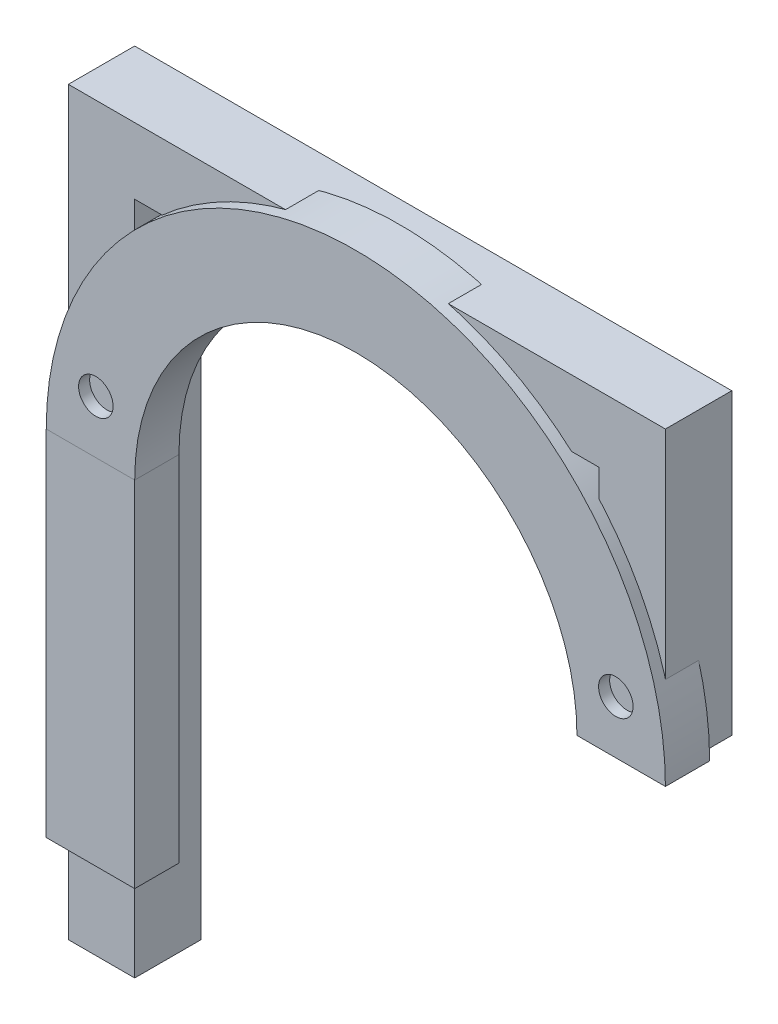
ISO-10303-21;
HEADER;
FILE_DESCRIPTION(('STEP AP214'),'2;1');
FILE_NAME('part.step','',(''),(''),'','','');
FILE_SCHEMA(('AUTOMOTIVE_DESIGN { 1 0 10303 214 1 1 1 1 }'));
ENDSEC;
DATA;
#1=APPLICATION_CONTEXT('core data for automotive mechanical design processes');
#2=APPLICATION_PROTOCOL_DEFINITION('international standard','automotive_design',2000,#1);
#3=PRODUCT_CONTEXT('',#1,'mechanical');
#4=PRODUCT('Part','Part','',(#3));
#5=PRODUCT_RELATED_PRODUCT_CATEGORY('part','',(#4));
#6=PRODUCT_DEFINITION_FORMATION('','',#4);
#7=PRODUCT_DEFINITION_CONTEXT('part definition',#1,'design');
#8=PRODUCT_DEFINITION('design','',#6,#7);
#9=PRODUCT_DEFINITION_SHAPE('','',#8);
#10=(LENGTH_UNIT() NAMED_UNIT(*) SI_UNIT(.MILLI.,.METRE.));
#11=(NAMED_UNIT(*) PLANE_ANGLE_UNIT() SI_UNIT($,.RADIAN.));
#12=(NAMED_UNIT(*) SI_UNIT($,.STERADIAN.) SOLID_ANGLE_UNIT());
#13=UNCERTAINTY_MEASURE_WITH_UNIT(LENGTH_MEASURE(1.E-05),#10,'distance_accuracy_value','');
#14=(GEOMETRIC_REPRESENTATION_CONTEXT(3) GLOBAL_UNCERTAINTY_ASSIGNED_CONTEXT((#13)) GLOBAL_UNIT_ASSIGNED_CONTEXT((#10,
#11,#12)) REPRESENTATION_CONTEXT('',''));
#15=CARTESIAN_POINT('',(0.,0.,0.));
#16=DIRECTION('',(0.,0.,1.));
#17=DIRECTION('',(1.,0.,0.));
#18=AXIS2_PLACEMENT_3D('',#15,#16,#17);
#19=CARTESIAN_POINT('',(-6.35,0.,0.));
#20=DIRECTION('',(-1.,0.,0.));
#21=DIRECTION('',(0.,0.,1.));
#22=AXIS2_PLACEMENT_3D('',#19,#20,#21);
#23=PLANE('',#22);
#24=DIRECTION('',(0.,1.,0.));
#25=VECTOR('',#24,1.);
#26=CARTESIAN_POINT('',(-6.35,0.,0.));
#27=LINE('',#26,#25);
#28=CARTESIAN_POINT('',(-6.35,12.7,0.));
#29=VERTEX_POINT('',#28);
#30=CARTESIAN_POINT('',(-6.35,63.5,0.));
#31=VERTEX_POINT('',#30);
#32=EDGE_CURVE('E163',#29,#31,#27,.T.);
#33=ORIENTED_EDGE('',*,*,#32,.F.);
#34=DIRECTION('',(0.,0.,-1.));
#35=VECTOR('',#34,1.);
#36=CARTESIAN_POINT('',(-6.35,12.7,6.35));
#37=LINE('',#36,#35);
#38=CARTESIAN_POINT('',(-6.35,12.7,6.35));
#39=VERTEX_POINT('',#38);
#40=EDGE_CURVE('E145',#39,#29,#37,.T.);
#41=ORIENTED_EDGE('',*,*,#40,.F.);
#42=DIRECTION('',(0.,1.,0.));
#43=VECTOR('',#42,1.);
#44=CARTESIAN_POINT('',(-6.35,0.,6.35));
#45=LINE('',#44,#43);
#46=CARTESIAN_POINT('',(-6.35,63.5,6.35));
#47=VERTEX_POINT('',#46);
#48=EDGE_CURVE('E175',#39,#47,#45,.T.);
#49=ORIENTED_EDGE('',*,*,#48,.T.);
#50=DIRECTION('',(0.,0.,1.));
#51=VECTOR('',#50,1.);
#52=CARTESIAN_POINT('',(-6.35,63.5,0.));
#53=LINE('',#52,#51);
#54=EDGE_CURVE('E172',#31,#47,#53,.T.);
#55=ORIENTED_EDGE('',*,*,#54,.F.);
#56=EDGE_LOOP('',(#33,#41,#49,#55));
#57=FACE_BOUND('',#56,.T.);
#58=ADVANCED_FACE('F45',(#57),#23,.T.);
#59=CARTESIAN_POINT('',(-6.35,0.,6.35));
#60=DIRECTION('',(0.,0.,1.));
#61=DIRECTION('',(1.,0.,0.));
#62=AXIS2_PLACEMENT_3D('',#59,#60,#61);
#63=PLANE('',#62);
#64=ORIENTED_EDGE('',*,*,#48,.F.);
#65=DIRECTION('',(-1.,0.,0.));
#66=VECTOR('',#65,1.);
#67=CARTESIAN_POINT('',(-6.35,12.7,6.35));
#68=LINE('',#67,#66);
#69=CARTESIAN_POINT('',(6.35,12.7,6.35));
#70=VERTEX_POINT('',#69);
#71=EDGE_CURVE('E157',#70,#39,#68,.T.);
#72=ORIENTED_EDGE('',*,*,#71,.F.);
#73=DIRECTION('',(0.,1.,0.));
#74=VECTOR('',#73,1.);
#75=CARTESIAN_POINT('',(6.35,0.,6.35));
#76=LINE('',#75,#74);
#77=CARTESIAN_POINT('',(6.35,63.5,6.35));
#78=VERTEX_POINT('',#77);
#79=EDGE_CURVE('E191',#70,#78,#76,.T.);
#80=ORIENTED_EDGE('',*,*,#79,.T.);
#81=DIRECTION('',(1.,0.,0.));
#82=VECTOR('',#81,1.);
#83=CARTESIAN_POINT('',(-6.35,63.5,6.35));
#84=LINE('',#83,#82);
#85=EDGE_CURVE('E177',#47,#78,#84,.T.);
#86=ORIENTED_EDGE('',*,*,#85,.F.);
#87=EDGE_LOOP('',(#64,#72,#80,#86));
#88=FACE_BOUND('',#87,.T.);
#89=ADVANCED_FACE('F262',(#88),#63,.T.);
#90=CARTESIAN_POINT('',(6.35,0.,0.));
#91=DIRECTION('',(1.,0.,0.));
#92=DIRECTION('',(0.,0.,-1.));
#93=AXIS2_PLACEMENT_3D('',#90,#91,#92);
#94=PLANE('',#93);
#95=ORIENTED_EDGE('',*,*,#79,.F.);
#96=DIRECTION('',(0.,0.,1.));
#97=VECTOR('',#96,1.);
#98=CARTESIAN_POINT('',(6.35,12.7,6.35));
#99=LINE('',#98,#97);
#100=CARTESIAN_POINT('',(6.35,12.7,0.));
#101=VERTEX_POINT('',#100);
#102=EDGE_CURVE('E155',#101,#70,#99,.T.);
#103=ORIENTED_EDGE('',*,*,#102,.F.);
#104=DIRECTION('',(0.,1.,0.));
#105=VECTOR('',#104,1.);
#106=CARTESIAN_POINT('',(6.35,0.,0.));
#107=LINE('',#106,#105);
#108=CARTESIAN_POINT('',(6.35,63.5,0.));
#109=VERTEX_POINT('',#108);
#110=EDGE_CURVE('E201',#101,#109,#107,.T.);
#111=ORIENTED_EDGE('',*,*,#110,.T.);
#112=DIRECTION('',(0.,0.,-1.));
#113=VECTOR('',#112,1.);
#114=CARTESIAN_POINT('',(6.35,63.5,0.));
#115=LINE('',#114,#113);
#116=EDGE_CURVE('E193',#78,#109,#115,.T.);
#117=ORIENTED_EDGE('',*,*,#116,.F.);
#118=EDGE_LOOP('',(#95,#103,#111,#117));
#119=FACE_BOUND('',#118,.T.);
#120=ADVANCED_FACE('F234',(#119),#94,.T.);
#121=CARTESIAN_POINT('',(-6.35,0.,0.));
#122=DIRECTION('',(0.,0.,-1.));
#123=DIRECTION('',(-1.,0.,0.));
#124=AXIS2_PLACEMENT_3D('',#121,#122,#123);
#125=PLANE('',#124);
#126=CARTESIAN_POINT('',(0.,6.35,0.));
#127=DIRECTION('',(0.,0.,-1.));
#128=DIRECTION('',(-1.,0.,0.));
#129=AXIS2_PLACEMENT_3D('',#126,#127,#128);
#130=CIRCLE('',#129,2.4765);
#131=CARTESIAN_POINT('',(-2.4765,6.35,0.));
#132=VERTEX_POINT('',#131);
#133=EDGE_CURVE('E400',#132,#132,#130,.T.);
#134=ORIENTED_EDGE('',*,*,#133,.F.);
#135=EDGE_LOOP('',(#134));
#136=FACE_BOUND('',#135,.T.);
#137=ORIENTED_EDGE('',*,*,#110,.F.);
#138=DIRECTION('',(1.,0.,0.));
#139=VECTOR('',#138,1.);
#140=CARTESIAN_POINT('',(-6.35,12.7,0.));
#141=LINE('',#140,#139);
#142=CARTESIAN_POINT('',(4.7625,12.7,0.));
#143=VERTEX_POINT('',#142);
#144=EDGE_CURVE('E147',#143,#101,#141,.T.);
#145=ORIENTED_EDGE('',*,*,#144,.F.);
#146=DIRECTION('',(0.,1.,0.));
#147=VECTOR('',#146,1.);
#148=CARTESIAN_POINT('',(4.7625,0.,0.));
#149=LINE('',#148,#147);
#150=CARTESIAN_POINT('',(4.7625,0.,0.));
#151=VERTEX_POINT('',#150);
#152=EDGE_CURVE('E129',#151,#143,#149,.T.);
#153=ORIENTED_EDGE('',*,*,#152,.F.);
#154=DIRECTION('',(1.,0.,0.));
#155=VECTOR('',#154,1.);
#156=CARTESIAN_POINT('',(-4.7625,0.,0.));
#157=LINE('',#156,#155);
#158=CARTESIAN_POINT('',(-4.7625,0.,0.));
#159=VERTEX_POINT('',#158);
#160=EDGE_CURVE('E121',#159,#151,#157,.T.);
#161=ORIENTED_EDGE('',*,*,#160,.F.);
#162=DIRECTION('',(0.,1.,0.));
#163=VECTOR('',#162,1.);
#164=CARTESIAN_POINT('',(-4.7625,0.,0.));
#165=LINE('',#164,#163);
#166=CARTESIAN_POINT('',(-4.7625,12.7,0.));
#167=VERTEX_POINT('',#166);
#168=EDGE_CURVE('E127',#159,#167,#165,.T.);
#169=ORIENTED_EDGE('',*,*,#168,.T.);
#170=EDGE_CURVE('E153',#29,#167,#141,.T.);
#171=ORIENTED_EDGE('',*,*,#170,.F.);
#172=ORIENTED_EDGE('',*,*,#32,.T.);
#173=DIRECTION('',(-1.,0.,0.));
#174=VECTOR('',#173,1.);
#175=CARTESIAN_POINT('',(-6.35,63.5,0.));
#176=LINE('',#175,#174);
#177=EDGE_CURVE('E188',#109,#31,#176,.T.);
#178=ORIENTED_EDGE('',*,*,#177,.F.);
#179=EDGE_LOOP('',(#137,#145,#153,#161,#169,#171,#172,#178));
#180=FACE_BOUND('',#179,.T.);
#181=ADVANCED_FACE('F124',(#136,#180),#125,.T.);
#182=CARTESIAN_POINT('',(76.2,63.5,0.));
#183=DIRECTION('',(0.,-1.,0.));
#184=DIRECTION('',(0.,0.,1.));
#185=AXIS2_PLACEMENT_3D('',#182,#183,#184);
#186=PLANE('',#185);
#187=DIRECTION('',(0.,0.,-1.));
#188=VECTOR('',#187,1.);
#189=CARTESIAN_POINT('',(69.85,63.5,0.));
#190=LINE('',#189,#188);
#191=CARTESIAN_POINT('',(69.85,63.5,6.35));
#192=VERTEX_POINT('',#191);
#193=CARTESIAN_POINT('',(69.85,63.5,0.));
#194=VERTEX_POINT('',#193);
#195=EDGE_CURVE('E198',#192,#194,#190,.T.);
#196=ORIENTED_EDGE('',*,*,#195,.T.);
#197=DIRECTION('',(1.,0.,0.));
#198=VECTOR('',#197,1.);
#199=CARTESIAN_POINT('',(82.55,63.5,0.));
#200=LINE('',#199,#198);
#201=CARTESIAN_POINT('',(82.55,63.5,0.));
#202=VERTEX_POINT('',#201);
#203=EDGE_CURVE('E12',#194,#202,#200,.T.);
#204=ORIENTED_EDGE('',*,*,#203,.T.);
#205=DIRECTION('',(0.,0.,1.));
#206=VECTOR('',#205,1.);
#207=CARTESIAN_POINT('',(82.55,63.5,0.));
#208=LINE('',#207,#206);
#209=CARTESIAN_POINT('',(82.55,63.5,6.35));
#210=VERTEX_POINT('',#209);
#211=EDGE_CURVE('E179',#202,#210,#208,.T.);
#212=ORIENTED_EDGE('',*,*,#211,.T.);
#213=DIRECTION('',(-1.,0.,0.));
#214=VECTOR('',#213,1.);
#215=CARTESIAN_POINT('',(82.55,63.5,6.35));
#216=LINE('',#215,#214);
#217=EDGE_CURVE('E185',#210,#192,#216,.T.);
#218=ORIENTED_EDGE('',*,*,#217,.T.);
#219=EDGE_LOOP('',(#196,#204,#212,#218));
#220=FACE_BOUND('',#219,.T.);
#221=ADVANCED_FACE('F47',(#220),#186,.T.);
#222=CARTESIAN_POINT('',(38.1,63.5,0.));
#223=DIRECTION('',(0.,0.,-1.));
#224=DIRECTION('',(-1.,0.,0.));
#225=AXIS2_PLACEMENT_3D('',#222,#223,#224);
#226=CYLINDRICAL_SURFACE('',#225,44.45);
#227=CARTESIAN_POINT('',(38.1,63.5,6.35));
#228=DIRECTION('',(0.,0.,-1.));
#229=DIRECTION('',(-1.,0.,0.));
#230=AXIS2_PLACEMENT_3D('',#227,#228,#229);
#231=CIRCLE('',#230,44.45);
#232=EDGE_CURVE('E181',#47,#210,#231,.T.);
#233=ORIENTED_EDGE('',*,*,#232,.T.);
#234=ORIENTED_EDGE('',*,*,#211,.F.);
#235=CARTESIAN_POINT('',(38.1,63.5,0.));
#236=DIRECTION('',(0.,0.,-1.));
#237=DIRECTION('',(-1.,0.,0.));
#238=AXIS2_PLACEMENT_3D('',#235,#236,#237);
#239=CIRCLE('',#238,44.45);
#240=EDGE_CURVE('E182',#31,#202,#239,.T.);
#241=ORIENTED_EDGE('',*,*,#240,.F.);
#242=ORIENTED_EDGE('',*,*,#54,.T.);
#243=EDGE_LOOP('',(#233,#234,#241,#242));
#244=FACE_BOUND('',#243,.T.);
#245=ADVANCED_FACE('F220',(#244),#226,.T.);
#246=CARTESIAN_POINT('',(-6.35,63.5,6.35));
#247=DIRECTION('',(0.,0.,1.));
#248=DIRECTION('',(1.,0.,0.));
#249=AXIS2_PLACEMENT_3D('',#246,#247,#248);
#250=PLANE('',#249);
#251=CARTESIAN_POINT('',(75.4302236800156,71.12,6.35));
#252=DIRECTION('',(0.,0.,1.));
#253=DIRECTION('',(1.,0.,0.));
#254=AXIS2_PLACEMENT_3D('',#251,#252,#253);
#255=CIRCLE('',#254,2.4765);
#256=CARTESIAN_POINT('',(77.9067236800156,71.12,6.35));
#257=VERTEX_POINT('',#256);
#258=EDGE_CURVE('E160',#257,#257,#255,.T.);
#259=ORIENTED_EDGE('',*,*,#258,.F.);
#260=EDGE_LOOP('',(#259));
#261=FACE_BOUND('',#260,.T.);
#262=CARTESIAN_POINT('',(0.769776319984358,71.12,6.35));
#263=DIRECTION('',(0.,0.,1.));
#264=DIRECTION('',(-1.,0.,0.));
#265=AXIS2_PLACEMENT_3D('',#262,#263,#264);
#266=CIRCLE('',#265,2.4765);
#267=CARTESIAN_POINT('',(-1.70672368001564,71.12,6.35));
#268=VERTEX_POINT('',#267);
#269=EDGE_CURVE('E167',#268,#268,#266,.T.);
#270=ORIENTED_EDGE('',*,*,#269,.F.);
#271=EDGE_LOOP('',(#270));
#272=FACE_BOUND('',#271,.T.);
#273=CARTESIAN_POINT('',(38.1,63.5,6.35));
#274=DIRECTION('',(0.,0.,-1.));
#275=DIRECTION('',(-1.,0.,0.));
#276=AXIS2_PLACEMENT_3D('',#273,#274,#275);
#277=CIRCLE('',#276,31.75);
#278=EDGE_CURVE('E195',#78,#192,#277,.T.);
#279=ORIENTED_EDGE('',*,*,#278,.T.);
#280=ORIENTED_EDGE('',*,*,#217,.F.);
#281=ORIENTED_EDGE('',*,*,#232,.F.);
#282=ORIENTED_EDGE('',*,*,#85,.T.);
#283=EDGE_LOOP('',(#279,#280,#281,#282));
#284=FACE_BOUND('',#283,.T.);
#285=ADVANCED_FACE('F226',(#261,#272,#284),#250,.T.);
#286=CARTESIAN_POINT('',(38.1,63.5,0.));
#287=DIRECTION('',(0.,0.,-1.));
#288=DIRECTION('',(-1.,0.,0.));
#289=AXIS2_PLACEMENT_3D('',#286,#287,#288);
#290=CYLINDRICAL_SURFACE('',#289,31.75);
#291=CARTESIAN_POINT('',(38.1,63.5,0.));
#292=DIRECTION('',(0.,0.,-1.));
#293=DIRECTION('',(-1.,0.,0.));
#294=AXIS2_PLACEMENT_3D('',#291,#292,#293);
#295=CIRCLE('',#294,31.75);
#296=EDGE_CURVE('E54',#109,#194,#295,.T.);
#297=ORIENTED_EDGE('',*,*,#296,.T.);
#298=ORIENTED_EDGE('',*,*,#195,.F.);
#299=ORIENTED_EDGE('',*,*,#278,.F.);
#300=ORIENTED_EDGE('',*,*,#116,.T.);
#301=EDGE_LOOP('',(#297,#298,#299,#300));
#302=FACE_BOUND('',#301,.T.);
#303=ADVANCED_FACE('F231',(#302),#290,.F.);
#304=CARTESIAN_POINT('',(-6.35,63.5,0.));
#305=DIRECTION('',(0.,0.,-1.));
#306=DIRECTION('',(-1.,0.,0.));
#307=AXIS2_PLACEMENT_3D('',#304,#305,#306);
#308=PLANE('',#307);
#309=CARTESIAN_POINT('',(75.4302236800156,71.12,0.));
#310=DIRECTION('',(0.,0.,1.));
#311=DIRECTION('',(1.,0.,0.));
#312=AXIS2_PLACEMENT_3D('',#309,#310,#311);
#313=CIRCLE('',#312,2.4765);
#314=CARTESIAN_POINT('',(77.9067236800156,71.12,0.));
#315=VERTEX_POINT('',#314);
#316=EDGE_CURVE('E164',#315,#315,#313,.T.);
#317=ORIENTED_EDGE('',*,*,#316,.T.);
#318=EDGE_LOOP('',(#317));
#319=FACE_BOUND('',#318,.T.);
#320=CARTESIAN_POINT('',(0.769776319984358,71.12,0.));
#321=DIRECTION('',(0.,0.,1.));
#322=DIRECTION('',(-1.,0.,0.));
#323=AXIS2_PLACEMENT_3D('',#320,#321,#322);
#324=CIRCLE('',#323,2.4765);
#325=CARTESIAN_POINT('',(-1.70672368001564,71.12,0.));
#326=VERTEX_POINT('',#325);
#327=EDGE_CURVE('E159',#326,#326,#324,.T.);
#328=ORIENTED_EDGE('',*,*,#327,.T.);
#329=EDGE_LOOP('',(#328));
#330=FACE_BOUND('',#329,.T.);
#331=ORIENTED_EDGE('',*,*,#203,.F.);
#332=ORIENTED_EDGE('',*,*,#296,.F.);
#333=ORIENTED_EDGE('',*,*,#177,.T.);
#334=ORIENTED_EDGE('',*,*,#240,.T.);
#335=EDGE_LOOP('',(#331,#332,#333,#334));
#336=FACE_BOUND('',#335,.T.);
#337=ADVANCED_FACE('F212',(#319,#330,#336),#308,.T.);
#338=CARTESIAN_POINT('',(0.769776319984358,71.12,6.35));
#339=DIRECTION('',(0.,0.,-1.));
#340=DIRECTION('',(-1.,0.,0.));
#341=AXIS2_PLACEMENT_3D('',#338,#339,#340);
#342=CYLINDRICAL_SURFACE('',#341,2.4765);
#343=ORIENTED_EDGE('',*,*,#269,.T.);
#344=EDGE_LOOP('',(#343));
#345=FACE_BOUND('',#344,.T.);
#346=ORIENTED_EDGE('',*,*,#327,.F.);
#347=EDGE_LOOP('',(#346));
#348=FACE_BOUND('',#347,.T.);
#349=ADVANCED_FACE('F258',(#345,#348),#342,.F.);
#350=CARTESIAN_POINT('',(75.4302236800156,71.12,6.35));
#351=DIRECTION('',(0.,0.,-1.));
#352=DIRECTION('',(-1.,0.,0.));
#353=AXIS2_PLACEMENT_3D('',#350,#351,#352);
#354=CYLINDRICAL_SURFACE('',#353,2.4765);
#355=ORIENTED_EDGE('',*,*,#258,.T.);
#356=EDGE_LOOP('',(#355));
#357=FACE_BOUND('',#356,.T.);
#358=ORIENTED_EDGE('',*,*,#316,.F.);
#359=EDGE_LOOP('',(#358));
#360=FACE_BOUND('',#359,.T.);
#361=ADVANCED_FACE('F251',(#357,#360),#354,.F.);
#362=CARTESIAN_POINT('',(0.,12.7,0.));
#363=DIRECTION('',(0.,-1.,0.));
#364=DIRECTION('',(0.,0.,-1.));
#365=AXIS2_PLACEMENT_3D('',#362,#363,#364);
#366=PLANE('',#365);
#367=DIRECTION('',(0.,0.,-1.));
#368=VECTOR('',#367,1.);
#369=CARTESIAN_POINT('',(-4.7625,12.7,0.));
#370=LINE('',#369,#368);
#371=CARTESIAN_POINT('',(-4.7625,12.7,4.7625));
#372=VERTEX_POINT('',#371);
#373=EDGE_CURVE('E61',#372,#167,#370,.T.);
#374=ORIENTED_EDGE('',*,*,#373,.F.);
#375=DIRECTION('',(-1.,0.,0.));
#376=VECTOR('',#375,1.);
#377=CARTESIAN_POINT('',(-4.7625,12.7,4.7625));
#378=LINE('',#377,#376);
#379=CARTESIAN_POINT('',(4.7625,12.7,4.7625));
#380=VERTEX_POINT('',#379);
#381=EDGE_CURVE('E142',#380,#372,#378,.T.);
#382=ORIENTED_EDGE('',*,*,#381,.F.);
#383=DIRECTION('',(0.,0.,1.));
#384=VECTOR('',#383,1.);
#385=CARTESIAN_POINT('',(4.7625,12.7,0.));
#386=LINE('',#385,#384);
#387=EDGE_CURVE('E67',#143,#380,#386,.T.);
#388=ORIENTED_EDGE('',*,*,#387,.F.);
#389=ORIENTED_EDGE('',*,*,#144,.T.);
#390=ORIENTED_EDGE('',*,*,#102,.T.);
#391=ORIENTED_EDGE('',*,*,#71,.T.);
#392=ORIENTED_EDGE('',*,*,#40,.T.);
#393=ORIENTED_EDGE('',*,*,#170,.T.);
#394=EDGE_LOOP('',(#374,#382,#388,#389,#390,#391,#392,#393));
#395=FACE_BOUND('',#394,.T.);
#396=ADVANCED_FACE('F249',(#395),#366,.T.);
#397=CARTESIAN_POINT('',(-4.7625,0.,0.));
#398=DIRECTION('',(1.,0.,0.));
#399=DIRECTION('',(0.,0.,-1.));
#400=AXIS2_PLACEMENT_3D('',#397,#398,#399);
#401=PLANE('',#400);
#402=ORIENTED_EDGE('',*,*,#373,.T.);
#403=ORIENTED_EDGE('',*,*,#168,.F.);
#404=DIRECTION('',(0.,0.,-1.));
#405=VECTOR('',#404,1.);
#406=CARTESIAN_POINT('',(-4.7625,0.,0.));
#407=LINE('',#406,#405);
#408=CARTESIAN_POINT('',(-4.7625,0.,4.7625));
#409=VERTEX_POINT('',#408);
#410=EDGE_CURVE('E133',#409,#159,#407,.T.);
#411=ORIENTED_EDGE('',*,*,#410,.F.);
#412=DIRECTION('',(0.,1.,0.));
#413=VECTOR('',#412,1.);
#414=CARTESIAN_POINT('',(-4.7625,0.,4.7625));
#415=LINE('',#414,#413);
#416=EDGE_CURVE('E241',#409,#372,#415,.T.);
#417=ORIENTED_EDGE('',*,*,#416,.T.);
#418=EDGE_LOOP('',(#402,#403,#411,#417));
#419=FACE_BOUND('',#418,.T.);
#420=ADVANCED_FACE('F144',(#419),#401,.F.);
#421=CARTESIAN_POINT('',(4.7625,0.,0.));
#422=DIRECTION('',(-1.,0.,0.));
#423=DIRECTION('',(0.,0.,1.));
#424=AXIS2_PLACEMENT_3D('',#421,#422,#423);
#425=PLANE('',#424);
#426=ORIENTED_EDGE('',*,*,#387,.T.);
#427=DIRECTION('',(0.,1.,0.));
#428=VECTOR('',#427,1.);
#429=CARTESIAN_POINT('',(4.7625,0.,4.7625));
#430=LINE('',#429,#428);
#431=CARTESIAN_POINT('',(4.7625,0.,4.7625));
#432=VERTEX_POINT('',#431);
#433=EDGE_CURVE('E149',#432,#380,#430,.T.);
#434=ORIENTED_EDGE('',*,*,#433,.F.);
#435=DIRECTION('',(0.,0.,1.));
#436=VECTOR('',#435,1.);
#437=CARTESIAN_POINT('',(4.7625,0.,0.));
#438=LINE('',#437,#436);
#439=EDGE_CURVE('E132',#151,#432,#438,.T.);
#440=ORIENTED_EDGE('',*,*,#439,.F.);
#441=ORIENTED_EDGE('',*,*,#152,.T.);
#442=EDGE_LOOP('',(#426,#434,#440,#441));
#443=FACE_BOUND('',#442,.T.);
#444=ADVANCED_FACE('F237',(#443),#425,.F.);
#445=CARTESIAN_POINT('',(-4.7625,0.,4.7625));
#446=DIRECTION('',(0.,0.,-1.));
#447=DIRECTION('',(-1.,0.,0.));
#448=AXIS2_PLACEMENT_3D('',#445,#446,#447);
#449=PLANE('',#448);
#450=CARTESIAN_POINT('',(0.,6.35,4.7625));
#451=DIRECTION('',(0.,0.,-1.));
#452=DIRECTION('',(-1.,0.,0.));
#453=AXIS2_PLACEMENT_3D('',#450,#451,#452);
#454=CIRCLE('',#453,2.4765);
#455=CARTESIAN_POINT('',(-2.4765,6.35,4.7625));
#456=VERTEX_POINT('',#455);
#457=EDGE_CURVE('E49',#456,#456,#454,.T.);
#458=ORIENTED_EDGE('',*,*,#457,.T.);
#459=EDGE_LOOP('',(#458));
#460=FACE_BOUND('',#459,.T.);
#461=ORIENTED_EDGE('',*,*,#381,.T.);
#462=ORIENTED_EDGE('',*,*,#416,.F.);
#463=DIRECTION('',(-1.,0.,0.));
#464=VECTOR('',#463,1.);
#465=CARTESIAN_POINT('',(-4.7625,0.,4.7625));
#466=LINE('',#465,#464);
#467=EDGE_CURVE('E138',#432,#409,#466,.T.);
#468=ORIENTED_EDGE('',*,*,#467,.F.);
#469=ORIENTED_EDGE('',*,*,#433,.T.);
#470=EDGE_LOOP('',(#461,#462,#468,#469));
#471=FACE_BOUND('',#470,.T.);
#472=ADVANCED_FACE('F248',(#460,#471),#449,.F.);
#473=CARTESIAN_POINT('',(0.,0.,0.));
#474=DIRECTION('',(0.,1.,0.));
#475=DIRECTION('',(0.,0.,1.));
#476=AXIS2_PLACEMENT_3D('',#473,#474,#475);
#477=PLANE('',#476);
#478=ORIENTED_EDGE('',*,*,#410,.T.);
#479=ORIENTED_EDGE('',*,*,#160,.T.);
#480=ORIENTED_EDGE('',*,*,#439,.T.);
#481=ORIENTED_EDGE('',*,*,#467,.T.);
#482=EDGE_LOOP('',(#478,#479,#480,#481));
#483=FACE_BOUND('',#482,.T.);
#484=ADVANCED_FACE('F136',(#483),#477,.F.);
#485=CARTESIAN_POINT('',(0.,6.35,6.35));
#486=DIRECTION('',(0.,0.,-1.));
#487=DIRECTION('',(-1.,0.,0.));
#488=AXIS2_PLACEMENT_3D('',#485,#486,#487);
#489=CYLINDRICAL_SURFACE('',#488,2.4765);
#490=ORIENTED_EDGE('',*,*,#133,.T.);
#491=EDGE_LOOP('',(#490));
#492=FACE_BOUND('',#491,.T.);
#493=ORIENTED_EDGE('',*,*,#457,.F.);
#494=EDGE_LOOP('',(#493));
#495=FACE_BOUND('',#494,.T.);
#496=ADVANCED_FACE('F375',(#492,#495),#489,.F.);
#497=CLOSED_SHELL('',(#58,#89,#120,#181,#221,#245,#285,#303,#337,#349,#361,#396,#420,#444,#472,
#484,#496));
#498=MANIFOLD_SOLID_BREP('B2',#497);
#499=CARTESIAN_POINT('',(71.4375,101.6,4.7625));
#500=DIRECTION('',(1.,0.,0.));
#501=DIRECTION('',(0.,0.,-1.));
#502=AXIS2_PLACEMENT_3D('',#499,#500,#501);
#503=PLANE('',#502);
#504=DIRECTION('',(0.,1.,0.));
#505=VECTOR('',#504,1.);
#506=CARTESIAN_POINT('',(71.4375,101.6,-4.7625));
#507=LINE('',#506,#505);
#508=CARTESIAN_POINT('',(71.4375,96.8375,-4.7625));
#509=VERTEX_POINT('',#508);
#510=CARTESIAN_POINT('',(71.4375,63.5,-4.7625));
#511=VERTEX_POINT('',#510);
#512=EDGE_CURVE('E514',#509,#511,#507,.F.);
#513=ORIENTED_EDGE('',*,*,#512,.T.);
#514=DIRECTION('',(0.,0.,-1.));
#515=VECTOR('',#514,1.);
#516=CARTESIAN_POINT('',(71.4375,63.5,4.7625));
#517=LINE('',#516,#515);
#518=CARTESIAN_POINT('',(71.4375,63.5,4.7625));
#519=VERTEX_POINT('',#518);
#520=EDGE_CURVE('E43',#519,#511,#517,.T.);
#521=ORIENTED_EDGE('',*,*,#520,.F.);
#522=DIRECTION('',(0.,1.,0.));
#523=VECTOR('',#522,1.);
#524=CARTESIAN_POINT('',(71.4375,101.6,4.7625));
#525=LINE('',#524,#523);
#526=CARTESIAN_POINT('',(71.4375,96.8375,4.7625));
#527=VERTEX_POINT('',#526);
#528=EDGE_CURVE('E472',#527,#519,#525,.F.);
#529=ORIENTED_EDGE('',*,*,#528,.F.);
#530=DIRECTION('',(0.,0.,-1.));
#531=VECTOR('',#530,1.);
#532=CARTESIAN_POINT('',(71.4375,96.8375,4.7625));
#533=LINE('',#532,#531);
#534=EDGE_CURVE('E513',#527,#509,#533,.T.);
#535=ORIENTED_EDGE('',*,*,#534,.T.);
#536=EDGE_LOOP('',(#513,#521,#529,#535));
#537=FACE_BOUND('',#536,.T.);
#538=ADVANCED_FACE('F417',(#537),#503,.F.);
#539=CARTESIAN_POINT('',(80.9625,63.5,4.7625));
#540=DIRECTION('',(0.,-1.,0.));
#541=DIRECTION('',(0.,0.,-1.));
#542=AXIS2_PLACEMENT_3D('',#539,#540,#541);
#543=PLANE('',#542);
#544=DIRECTION('',(-1.,0.,0.));
#545=VECTOR('',#544,1.);
#546=CARTESIAN_POINT('',(80.9625,63.5,-4.7625));
#547=LINE('',#546,#545);
#548=CARTESIAN_POINT('',(80.9625,63.5,-4.7625));
#549=VERTEX_POINT('',#548);
#550=EDGE_CURVE('E517',#549,#511,#547,.T.);
#551=ORIENTED_EDGE('',*,*,#550,.F.);
#552=DIRECTION('',(0.,0.,-1.));
#553=VECTOR('',#552,1.);
#554=CARTESIAN_POINT('',(80.9625,63.5,4.7625));
#555=LINE('',#554,#553);
#556=CARTESIAN_POINT('',(80.9625,63.5,4.7625));
#557=VERTEX_POINT('',#556);
#558=EDGE_CURVE('E425',#557,#549,#555,.T.);
#559=ORIENTED_EDGE('',*,*,#558,.F.);
#560=DIRECTION('',(-1.,0.,0.));
#561=VECTOR('',#560,1.);
#562=CARTESIAN_POINT('',(80.9625,63.5,4.7625));
#563=LINE('',#562,#561);
#564=EDGE_CURVE('E556',#557,#519,#563,.T.);
#565=ORIENTED_EDGE('',*,*,#564,.T.);
#566=ORIENTED_EDGE('',*,*,#520,.T.);
#567=EDGE_LOOP('',(#551,#559,#565,#566));
#568=FACE_BOUND('',#567,.T.);
#569=ADVANCED_FACE('F547',(#568),#543,.T.);
#570=CARTESIAN_POINT('',(80.9625,101.6,4.7625));
#571=DIRECTION('',(1.,0.,0.));
#572=DIRECTION('',(0.,0.,-1.));
#573=AXIS2_PLACEMENT_3D('',#570,#571,#572);
#574=PLANE('',#573);
#575=DIRECTION('',(0.,1.,0.));
#576=VECTOR('',#575,1.);
#577=CARTESIAN_POINT('',(80.9625,101.6,-4.7625));
#578=LINE('',#577,#576);
#579=CARTESIAN_POINT('',(80.9625,106.3625,-4.7625));
#580=VERTEX_POINT('',#579);
#581=EDGE_CURVE('E520',#580,#549,#578,.F.);
#582=ORIENTED_EDGE('',*,*,#581,.F.);
#583=DIRECTION('',(0.,0.,-1.));
#584=VECTOR('',#583,1.);
#585=CARTESIAN_POINT('',(80.9625,106.3625,4.7625));
#586=LINE('',#585,#584);
#587=CARTESIAN_POINT('',(80.9625,106.3625,4.7625));
#588=VERTEX_POINT('',#587);
#589=EDGE_CURVE('E537',#588,#580,#586,.T.);
#590=ORIENTED_EDGE('',*,*,#589,.F.);
#591=DIRECTION('',(0.,1.,0.));
#592=VECTOR('',#591,1.);
#593=CARTESIAN_POINT('',(80.9625,101.6,4.7625));
#594=LINE('',#593,#592);
#595=EDGE_CURVE('E544',#588,#557,#594,.F.);
#596=ORIENTED_EDGE('',*,*,#595,.T.);
#597=ORIENTED_EDGE('',*,*,#558,.T.);
#598=EDGE_LOOP('',(#582,#590,#596,#597));
#599=FACE_BOUND('',#598,.T.);
#600=ADVANCED_FACE('F542',(#599),#574,.T.);
#601=CARTESIAN_POINT('',(0.,106.3625,4.7625));
#602=DIRECTION('',(0.,1.,0.));
#603=DIRECTION('',(0.,0.,1.));
#604=AXIS2_PLACEMENT_3D('',#601,#602,#603);
#605=PLANE('',#604);
#606=DIRECTION('',(1.,0.,0.));
#607=VECTOR('',#606,1.);
#608=CARTESIAN_POINT('',(0.,106.3625,-4.7625));
#609=LINE('',#608,#607);
#610=CARTESIAN_POINT('',(-4.7625,106.3625,-4.7625));
#611=VERTEX_POINT('',#610);
#612=EDGE_CURVE('E523',#611,#580,#609,.T.);
#613=ORIENTED_EDGE('',*,*,#612,.F.);
#614=DIRECTION('',(0.,0.,-1.));
#615=VECTOR('',#614,1.);
#616=CARTESIAN_POINT('',(-4.7625,106.3625,4.7625));
#617=LINE('',#616,#615);
#618=CARTESIAN_POINT('',(-4.7625,106.3625,4.7625));
#619=VERTEX_POINT('',#618);
#620=EDGE_CURVE('E535',#619,#611,#617,.T.);
#621=ORIENTED_EDGE('',*,*,#620,.F.);
#622=DIRECTION('',(1.,0.,0.));
#623=VECTOR('',#622,1.);
#624=CARTESIAN_POINT('',(0.,106.3625,4.7625));
#625=LINE('',#624,#623);
#626=EDGE_CURVE('E508',#619,#588,#625,.T.);
#627=ORIENTED_EDGE('',*,*,#626,.T.);
#628=ORIENTED_EDGE('',*,*,#589,.T.);
#629=EDGE_LOOP('',(#613,#621,#627,#628));
#630=FACE_BOUND('',#629,.T.);
#631=ADVANCED_FACE('F554',(#630),#605,.T.);
#632=CARTESIAN_POINT('',(-4.7625,0.,4.7625));
#633=DIRECTION('',(-1.,0.,0.));
#634=DIRECTION('',(0.,0.,1.));
#635=AXIS2_PLACEMENT_3D('',#632,#633,#634);
#636=PLANE('',#635);
#637=DIRECTION('',(0.,1.,0.));
#638=VECTOR('',#637,1.);
#639=CARTESIAN_POINT('',(-4.7625,0.,-4.7625));
#640=LINE('',#639,#638);
#641=CARTESIAN_POINT('',(-4.7625,0.,-4.7625));
#642=VERTEX_POINT('',#641);
#643=EDGE_CURVE('E526',#642,#611,#640,.T.);
#644=ORIENTED_EDGE('',*,*,#643,.F.);
#645=DIRECTION('',(0.,0.,-1.));
#646=VECTOR('',#645,1.);
#647=CARTESIAN_POINT('',(-4.7625,0.,4.7625));
#648=LINE('',#647,#646);
#649=CARTESIAN_POINT('',(-4.7625,0.,4.7625));
#650=VERTEX_POINT('',#649);
#651=EDGE_CURVE('E496',#650,#642,#648,.T.);
#652=ORIENTED_EDGE('',*,*,#651,.F.);
#653=DIRECTION('',(0.,1.,0.));
#654=VECTOR('',#653,1.);
#655=CARTESIAN_POINT('',(-4.7625,0.,4.7625));
#656=LINE('',#655,#654);
#657=EDGE_CURVE('E506',#650,#619,#656,.T.);
#658=ORIENTED_EDGE('',*,*,#657,.T.);
#659=ORIENTED_EDGE('',*,*,#620,.T.);
#660=EDGE_LOOP('',(#644,#652,#658,#659));
#661=FACE_BOUND('',#660,.T.);
#662=ADVANCED_FACE('F561',(#661),#636,.T.);
#663=CARTESIAN_POINT('',(4.7625,0.,4.7625));
#664=DIRECTION('',(0.,-1.,0.));
#665=DIRECTION('',(0.,0.,-1.));
#666=AXIS2_PLACEMENT_3D('',#663,#664,#665);
#667=PLANE('',#666);
#668=DIRECTION('',(-1.,0.,0.));
#669=VECTOR('',#668,1.);
#670=CARTESIAN_POINT('',(4.7625,0.,-4.7625));
#671=LINE('',#670,#669);
#672=CARTESIAN_POINT('',(4.7625,0.,-4.7625));
#673=VERTEX_POINT('',#672);
#674=EDGE_CURVE('E495',#673,#642,#671,.T.);
#675=ORIENTED_EDGE('',*,*,#674,.F.);
#676=DIRECTION('',(0.,0.,-1.));
#677=VECTOR('',#676,1.);
#678=CARTESIAN_POINT('',(4.7625,0.,4.7625));
#679=LINE('',#678,#677);
#680=CARTESIAN_POINT('',(4.7625,0.,4.7625));
#681=VERTEX_POINT('',#680);
#682=EDGE_CURVE('E489',#681,#673,#679,.T.);
#683=ORIENTED_EDGE('',*,*,#682,.F.);
#684=DIRECTION('',(-1.,0.,0.));
#685=VECTOR('',#684,1.);
#686=CARTESIAN_POINT('',(4.7625,0.,4.7625));
#687=LINE('',#686,#685);
#688=EDGE_CURVE('E493',#681,#650,#687,.T.);
#689=ORIENTED_EDGE('',*,*,#688,.T.);
#690=ORIENTED_EDGE('',*,*,#651,.T.);
#691=EDGE_LOOP('',(#675,#683,#689,#690));
#692=FACE_BOUND('',#691,.T.);
#693=ADVANCED_FACE('F491',(#692),#667,.T.);
#694=CARTESIAN_POINT('',(4.7625,0.,4.7625));
#695=DIRECTION('',(-1.,0.,0.));
#696=DIRECTION('',(0.,0.,1.));
#697=AXIS2_PLACEMENT_3D('',#694,#695,#696);
#698=PLANE('',#697);
#699=DIRECTION('',(0.,1.,0.));
#700=VECTOR('',#699,1.);
#701=CARTESIAN_POINT('',(4.7625,0.,-4.7625));
#702=LINE('',#701,#700);
#703=CARTESIAN_POINT('',(4.7625,96.8375,-4.7625));
#704=VERTEX_POINT('',#703);
#705=EDGE_CURVE('E460',#673,#704,#702,.T.);
#706=ORIENTED_EDGE('',*,*,#705,.T.);
#707=DIRECTION('',(0.,0.,-1.));
#708=VECTOR('',#707,1.);
#709=CARTESIAN_POINT('',(4.7625,96.8375,4.7625));
#710=LINE('',#709,#708);
#711=CARTESIAN_POINT('',(4.7625,96.8375,4.7625));
#712=VERTEX_POINT('',#711);
#713=EDGE_CURVE('E497',#712,#704,#710,.T.);
#714=ORIENTED_EDGE('',*,*,#713,.F.);
#715=DIRECTION('',(0.,1.,0.));
#716=VECTOR('',#715,1.);
#717=CARTESIAN_POINT('',(4.7625,0.,4.7625));
#718=LINE('',#717,#716);
#719=EDGE_CURVE('E499',#681,#712,#718,.T.);
#720=ORIENTED_EDGE('',*,*,#719,.F.);
#721=ORIENTED_EDGE('',*,*,#682,.T.);
#722=EDGE_LOOP('',(#706,#714,#720,#721));
#723=FACE_BOUND('',#722,.T.);
#724=ADVANCED_FACE('F500',(#723),#698,.F.);
#725=CARTESIAN_POINT('',(0.,96.8375,4.7625));
#726=DIRECTION('',(0.,1.,0.));
#727=DIRECTION('',(0.,0.,1.));
#728=AXIS2_PLACEMENT_3D('',#725,#726,#727);
#729=PLANE('',#728);
#730=DIRECTION('',(1.,0.,0.));
#731=VECTOR('',#730,1.);
#732=CARTESIAN_POINT('',(0.,96.8375,-4.7625));
#733=LINE('',#732,#731);
#734=EDGE_CURVE('E466',#704,#509,#733,.T.);
#735=ORIENTED_EDGE('',*,*,#734,.T.);
#736=ORIENTED_EDGE('',*,*,#534,.F.);
#737=DIRECTION('',(1.,0.,0.));
#738=VECTOR('',#737,1.);
#739=CARTESIAN_POINT('',(0.,96.8375,4.7625));
#740=LINE('',#739,#738);
#741=EDGE_CURVE('E433',#712,#527,#740,.T.);
#742=ORIENTED_EDGE('',*,*,#741,.F.);
#743=ORIENTED_EDGE('',*,*,#713,.T.);
#744=EDGE_LOOP('',(#735,#736,#742,#743));
#745=FACE_BOUND('',#744,.T.);
#746=ADVANCED_FACE('F563',(#745),#729,.F.);
#747=CARTESIAN_POINT('',(0.,0.,4.7625));
#748=DIRECTION('',(0.,0.,1.));
#749=DIRECTION('',(1.,0.,0.));
#750=AXIS2_PLACEMENT_3D('',#747,#748,#749);
#751=PLANE('',#750);
#752=ORIENTED_EDGE('',*,*,#528,.T.);
#753=ORIENTED_EDGE('',*,*,#564,.F.);
#754=ORIENTED_EDGE('',*,*,#595,.F.);
#755=ORIENTED_EDGE('',*,*,#626,.F.);
#756=ORIENTED_EDGE('',*,*,#657,.F.);
#757=ORIENTED_EDGE('',*,*,#688,.F.);
#758=ORIENTED_EDGE('',*,*,#719,.T.);
#759=ORIENTED_EDGE('',*,*,#741,.T.);
#760=EDGE_LOOP('',(#752,#753,#754,#755,#756,#757,#758,#759));
#761=FACE_BOUND('',#760,.T.);
#762=ADVANCED_FACE('F503',(#761),#751,.T.);
#763=CARTESIAN_POINT('',(0.,0.,-4.7625));
#764=DIRECTION('',(0.,0.,1.));
#765=DIRECTION('',(1.,0.,0.));
#766=AXIS2_PLACEMENT_3D('',#763,#764,#765);
#767=PLANE('',#766);
#768=ORIENTED_EDGE('',*,*,#512,.F.);
#769=ORIENTED_EDGE('',*,*,#734,.F.);
#770=ORIENTED_EDGE('',*,*,#705,.F.);
#771=ORIENTED_EDGE('',*,*,#674,.T.);
#772=ORIENTED_EDGE('',*,*,#643,.T.);
#773=ORIENTED_EDGE('',*,*,#612,.T.);
#774=ORIENTED_EDGE('',*,*,#581,.T.);
#775=ORIENTED_EDGE('',*,*,#550,.T.);
#776=EDGE_LOOP('',(#768,#769,#770,#771,#772,#773,#774,#775));
#777=FACE_BOUND('',#776,.T.);
#778=ADVANCED_FACE('F550',(#777),#767,.F.);
#779=CLOSED_SHELL('',(#538,#569,#600,#631,#662,#693,#724,#746,#762,#778));
#780=MANIFOLD_SOLID_BREP('B6_NOT_SHOWN',#779);
#781=ADVANCED_BREP_SHAPE_REPRESENTATION('',(#18,#498,#780),#14);
#782=SHAPE_DEFINITION_REPRESENTATION(#9,#781);
ENDSEC;
END-ISO-10303-21;
